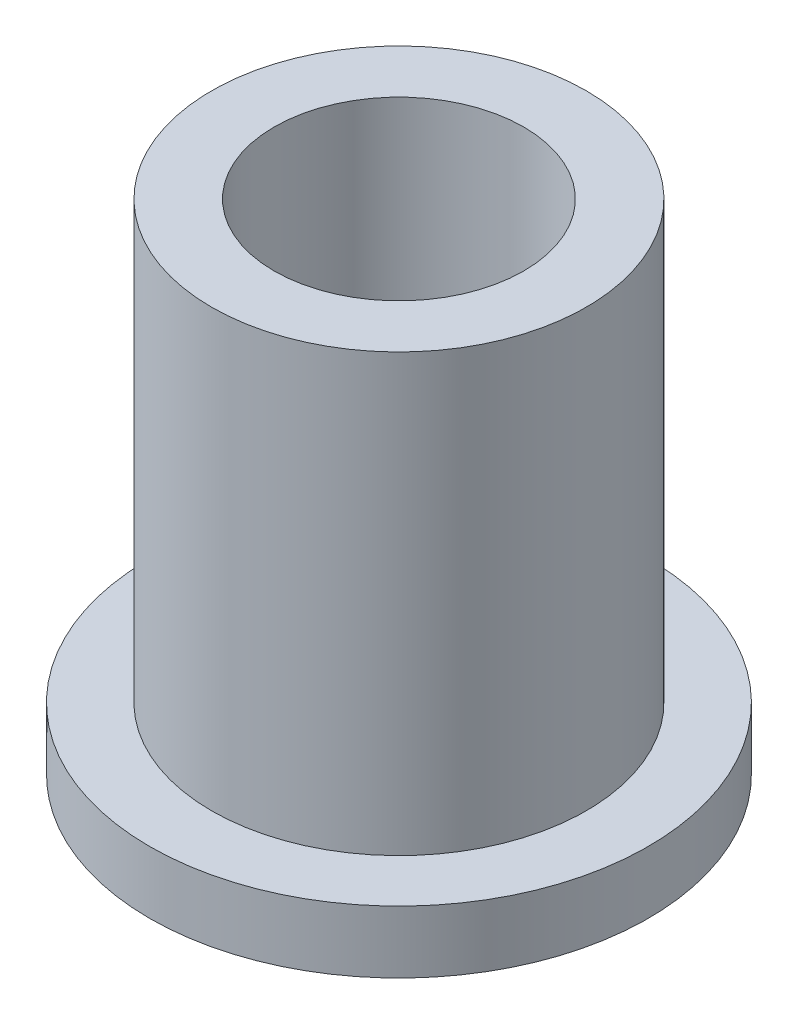
ISO-10303-21;
HEADER;
FILE_DESCRIPTION(('STEP AP214'),'2;1');
FILE_NAME('part.step','',(''),(''),'','','');
FILE_SCHEMA(('AUTOMOTIVE_DESIGN { 1 0 10303 214 1 1 1 1 }'));
ENDSEC;
DATA;
#1=APPLICATION_CONTEXT('core data for automotive mechanical design processes');
#2=APPLICATION_PROTOCOL_DEFINITION('international standard','automotive_design',2000,#1);
#3=PRODUCT_CONTEXT('',#1,'mechanical');
#4=PRODUCT('Part','Part','',(#3));
#5=PRODUCT_RELATED_PRODUCT_CATEGORY('part','',(#4));
#6=PRODUCT_DEFINITION_FORMATION('','',#4);
#7=PRODUCT_DEFINITION_CONTEXT('part definition',#1,'design');
#8=PRODUCT_DEFINITION('design','',#6,#7);
#9=PRODUCT_DEFINITION_SHAPE('','',#8);
#10=(LENGTH_UNIT() NAMED_UNIT(*) SI_UNIT(.MILLI.,.METRE.));
#11=(NAMED_UNIT(*) PLANE_ANGLE_UNIT() SI_UNIT($,.RADIAN.));
#12=(NAMED_UNIT(*) SI_UNIT($,.STERADIAN.) SOLID_ANGLE_UNIT());
#13=UNCERTAINTY_MEASURE_WITH_UNIT(LENGTH_MEASURE(1.E-05),#10,'distance_accuracy_value','');
#14=(GEOMETRIC_REPRESENTATION_CONTEXT(3) GLOBAL_UNCERTAINTY_ASSIGNED_CONTEXT((#13)) GLOBAL_UNIT_ASSIGNED_CONTEXT((#10,
#11,#12)) REPRESENTATION_CONTEXT('',''));
#15=CARTESIAN_POINT('',(0.,0.,0.));
#16=DIRECTION('',(0.,0.,1.));
#17=DIRECTION('',(1.,0.,0.));
#18=AXIS2_PLACEMENT_3D('',#15,#16,#17);
#19=CARTESIAN_POINT('',(0.,16.,0.));
#20=DIRECTION('',(0.,1.,0.));
#21=DIRECTION('',(0.,0.,1.));
#22=AXIS2_PLACEMENT_3D('',#19,#20,#21);
#23=PLANE('',#22);
#24=CARTESIAN_POINT('',(0.,16.,0.));
#25=DIRECTION('',(0.,1.,0.));
#26=DIRECTION('',(0.,0.,1.));
#27=AXIS2_PLACEMENT_3D('',#24,#25,#26);
#28=CIRCLE('',#27,6.015);
#29=CARTESIAN_POINT('',(0.,16.,6.015));
#30=VERTEX_POINT('',#29);
#31=EDGE_CURVE('E10',#30,#30,#28,.T.);
#32=ORIENTED_EDGE('',*,*,#31,.T.);
#33=EDGE_LOOP('',(#32));
#34=FACE_BOUND('',#33,.T.);
#35=CARTESIAN_POINT('',(0.,16.,0.));
#36=DIRECTION('',(0.,1.,0.));
#37=DIRECTION('',(0.,0.,1.));
#38=AXIS2_PLACEMENT_3D('',#35,#36,#37);
#39=CIRCLE('',#38,4.005);
#40=CARTESIAN_POINT('',(0.,16.,4.005));
#41=VERTEX_POINT('',#40);
#42=EDGE_CURVE('E44',#41,#41,#39,.T.);
#43=ORIENTED_EDGE('',*,*,#42,.F.);
#44=EDGE_LOOP('',(#43));
#45=FACE_BOUND('',#44,.T.);
#46=ADVANCED_FACE('F36',(#34,#45),#23,.T.);
#47=CARTESIAN_POINT('',(0.,0.,0.));
#48=DIRECTION('',(0.,1.,0.));
#49=DIRECTION('',(0.,0.,1.));
#50=AXIS2_PLACEMENT_3D('',#47,#48,#49);
#51=PLANE('',#50);
#52=CARTESIAN_POINT('',(0.,0.,0.));
#53=DIRECTION('',(0.,1.,0.));
#54=DIRECTION('',(0.,0.,1.));
#55=AXIS2_PLACEMENT_3D('',#52,#53,#54);
#56=CIRCLE('',#55,4.005);
#57=CARTESIAN_POINT('',(0.,0.,4.005));
#58=VERTEX_POINT('',#57);
#59=EDGE_CURVE('E49',#58,#58,#56,.T.);
#60=ORIENTED_EDGE('',*,*,#59,.T.);
#61=EDGE_LOOP('',(#60));
#62=FACE_BOUND('',#61,.T.);
#63=CARTESIAN_POINT('',(0.,0.,0.));
#64=DIRECTION('',(0.,1.,0.));
#65=DIRECTION('',(0.,0.,1.));
#66=AXIS2_PLACEMENT_3D('',#63,#64,#65);
#67=CIRCLE('',#66,8.);
#68=CARTESIAN_POINT('',(0.,0.,8.));
#69=VERTEX_POINT('',#68);
#70=EDGE_CURVE('E57',#69,#69,#67,.T.);
#71=ORIENTED_EDGE('',*,*,#70,.F.);
#72=EDGE_LOOP('',(#71));
#73=FACE_BOUND('',#72,.T.);
#74=ADVANCED_FACE('F84',(#62,#73),#51,.F.);
#75=CARTESIAN_POINT('',(0.,16.,0.));
#76=DIRECTION('',(0.,-1.,0.));
#77=DIRECTION('',(0.,0.,-1.));
#78=AXIS2_PLACEMENT_3D('',#75,#76,#77);
#79=CYLINDRICAL_SURFACE('',#78,6.015);
#80=CARTESIAN_POINT('',(0.,2.,0.));
#81=DIRECTION('',(0.,1.,0.));
#82=DIRECTION('',(0.,0.,1.));
#83=AXIS2_PLACEMENT_3D('',#80,#81,#82);
#84=CIRCLE('',#83,6.015);
#85=CARTESIAN_POINT('',(0.,2.,6.015));
#86=VERTEX_POINT('',#85);
#87=EDGE_CURVE('E61',#86,#86,#84,.T.);
#88=ORIENTED_EDGE('',*,*,#87,.T.);
#89=EDGE_LOOP('',(#88));
#90=FACE_BOUND('',#89,.T.);
#91=ORIENTED_EDGE('',*,*,#31,.F.);
#92=EDGE_LOOP('',(#91));
#93=FACE_BOUND('',#92,.T.);
#94=ADVANCED_FACE('F38',(#90,#93),#79,.T.);
#95=CARTESIAN_POINT('',(0.,16.,0.));
#96=DIRECTION('',(0.,-1.,0.));
#97=DIRECTION('',(0.,0.,-1.));
#98=AXIS2_PLACEMENT_3D('',#95,#96,#97);
#99=CYLINDRICAL_SURFACE('',#98,4.005);
#100=ORIENTED_EDGE('',*,*,#42,.T.);
#101=EDGE_LOOP('',(#100));
#102=FACE_BOUND('',#101,.T.);
#103=ORIENTED_EDGE('',*,*,#59,.F.);
#104=EDGE_LOOP('',(#103));
#105=FACE_BOUND('',#104,.T.);
#106=ADVANCED_FACE('F73',(#102,#105),#99,.F.);
#107=CARTESIAN_POINT('',(0.,2.,0.));
#108=DIRECTION('',(0.,1.,0.));
#109=DIRECTION('',(0.,0.,1.));
#110=AXIS2_PLACEMENT_3D('',#107,#108,#109);
#111=PLANE('',#110);
#112=CARTESIAN_POINT('',(0.,2.,0.));
#113=DIRECTION('',(0.,1.,0.));
#114=DIRECTION('',(0.,0.,1.));
#115=AXIS2_PLACEMENT_3D('',#112,#113,#114);
#116=CIRCLE('',#115,8.);
#117=CARTESIAN_POINT('',(0.,2.,8.));
#118=VERTEX_POINT('',#117);
#119=EDGE_CURVE('E55',#118,#118,#116,.T.);
#120=ORIENTED_EDGE('',*,*,#119,.T.);
#121=EDGE_LOOP('',(#120));
#122=FACE_BOUND('',#121,.T.);
#123=ORIENTED_EDGE('',*,*,#87,.F.);
#124=EDGE_LOOP('',(#123));
#125=FACE_BOUND('',#124,.T.);
#126=ADVANCED_FACE('F70',(#122,#125),#111,.T.);
#127=CARTESIAN_POINT('',(0.,2.,0.));
#128=DIRECTION('',(0.,-1.,0.));
#129=DIRECTION('',(0.,0.,-1.));
#130=AXIS2_PLACEMENT_3D('',#127,#128,#129);
#131=CYLINDRICAL_SURFACE('',#130,8.);
#132=ORIENTED_EDGE('',*,*,#119,.F.);
#133=EDGE_LOOP('',(#132));
#134=FACE_BOUND('',#133,.T.);
#135=ORIENTED_EDGE('',*,*,#70,.T.);
#136=EDGE_LOOP('',(#135));
#137=FACE_BOUND('',#136,.T.);
#138=ADVANCED_FACE('F72',(#134,#137),#131,.T.);
#139=CLOSED_SHELL('',(#46,#74,#94,#106,#126,#138));
#140=MANIFOLD_SOLID_BREP('B2',#139);
#141=ADVANCED_BREP_SHAPE_REPRESENTATION('',(#18,#140),#14);
#142=SHAPE_DEFINITION_REPRESENTATION(#9,#141);
ENDSEC;
END-ISO-10303-21;
